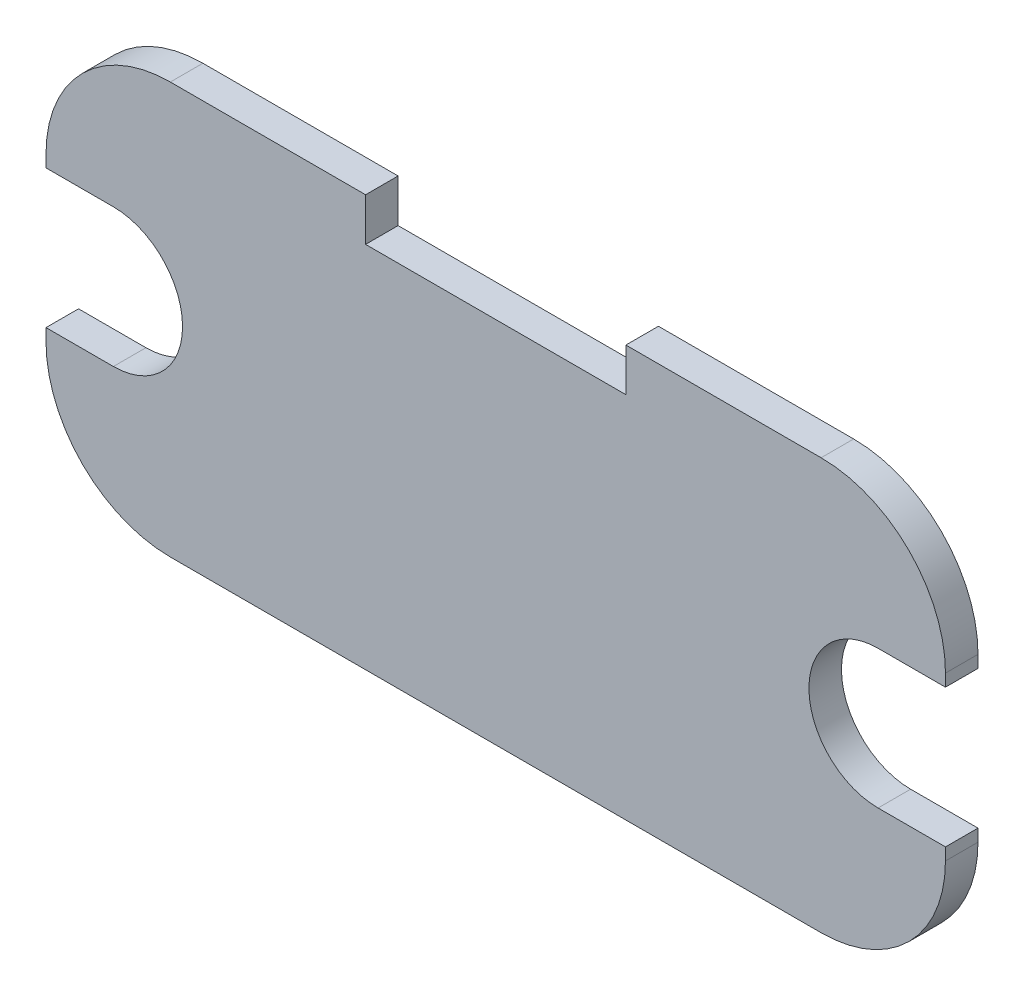
ISO-10303-21;
HEADER;
FILE_DESCRIPTION(('STEP AP214'),'2;1');
FILE_NAME('part.step','',(''),(''),'','','');
FILE_SCHEMA(('AUTOMOTIVE_DESIGN { 1 0 10303 214 1 1 1 1 }'));
ENDSEC;
DATA;
#1=APPLICATION_CONTEXT('core data for automotive mechanical design processes');
#2=APPLICATION_PROTOCOL_DEFINITION('international standard','automotive_design',2000,#1);
#3=PRODUCT_CONTEXT('',#1,'mechanical');
#4=PRODUCT('Part','Part','',(#3));
#5=PRODUCT_RELATED_PRODUCT_CATEGORY('part','',(#4));
#6=PRODUCT_DEFINITION_FORMATION('','',#4);
#7=PRODUCT_DEFINITION_CONTEXT('part definition',#1,'design');
#8=PRODUCT_DEFINITION('design','',#6,#7);
#9=PRODUCT_DEFINITION_SHAPE('','',#8);
#10=(LENGTH_UNIT() NAMED_UNIT(*) SI_UNIT(.MILLI.,.METRE.));
#11=(NAMED_UNIT(*) PLANE_ANGLE_UNIT() SI_UNIT($,.RADIAN.));
#12=(NAMED_UNIT(*) SI_UNIT($,.STERADIAN.) SOLID_ANGLE_UNIT());
#13=UNCERTAINTY_MEASURE_WITH_UNIT(LENGTH_MEASURE(1.E-05),#10,'distance_accuracy_value','');
#14=(GEOMETRIC_REPRESENTATION_CONTEXT(3) GLOBAL_UNCERTAINTY_ASSIGNED_CONTEXT((#13)) GLOBAL_UNIT_ASSIGNED_CONTEXT((#10,
#11,#12)) REPRESENTATION_CONTEXT('',''));
#15=CARTESIAN_POINT('',(0.,0.,0.));
#16=DIRECTION('',(0.,0.,1.));
#17=DIRECTION('',(1.,0.,0.));
#18=AXIS2_PLACEMENT_3D('',#15,#16,#17);
#19=CARTESIAN_POINT('',(27.6424107016852,0.,2.));
#20=DIRECTION('',(1.,0.,0.));
#21=DIRECTION('',(0.,0.,-1.));
#22=AXIS2_PLACEMENT_3D('',#19,#20,#21);
#23=PLANE('',#22);
#24=DIRECTION('',(0.,0.,1.));
#25=VECTOR('',#24,1.);
#26=CARTESIAN_POINT('',(27.6424107016852,7.25000000000002,2.));
#27=LINE('',#26,#25);
#28=CARTESIAN_POINT('',(27.6424107016852,7.25000000000002,0.));
#29=VERTEX_POINT('',#28);
#30=CARTESIAN_POINT('',(27.6424107016852,7.25000000000002,2.));
#31=VERTEX_POINT('',#30);
#32=EDGE_CURVE('E201',#29,#31,#27,.T.);
#33=ORIENTED_EDGE('',*,*,#32,.F.);
#34=DIRECTION('',(0.,-1.,0.));
#35=VECTOR('',#34,1.);
#36=CARTESIAN_POINT('',(27.6424107016852,0.,0.));
#37=LINE('',#36,#35);
#38=CARTESIAN_POINT('',(27.6424107016852,8.,0.));
#39=VERTEX_POINT('',#38);
#40=EDGE_CURVE('E268',#39,#29,#37,.T.);
#41=ORIENTED_EDGE('',*,*,#40,.F.);
#42=DIRECTION('',(0.,0.,-1.));
#43=VECTOR('',#42,1.);
#44=CARTESIAN_POINT('',(27.6424107016852,8.,2.));
#45=LINE('',#44,#43);
#46=CARTESIAN_POINT('',(27.6424107016852,8.,2.));
#47=VERTEX_POINT('',#46);
#48=EDGE_CURVE('E313',#47,#39,#45,.T.);
#49=ORIENTED_EDGE('',*,*,#48,.F.);
#50=DIRECTION('',(0.,-1.,0.));
#51=VECTOR('',#50,1.);
#52=CARTESIAN_POINT('',(27.6424107016852,0.,2.));
#53=LINE('',#52,#51);
#54=EDGE_CURVE('E233',#47,#31,#53,.T.);
#55=ORIENTED_EDGE('',*,*,#54,.T.);
#56=EDGE_LOOP('',(#33,#41,#49,#55));
#57=FACE_BOUND('',#56,.T.);
#58=ADVANCED_FACE('F36',(#57),#23,.T.);
#59=CARTESIAN_POINT('',(-27.6424107016852,0.,2.));
#60=DIRECTION('',(1.,0.,0.));
#61=DIRECTION('',(0.,0.,-1.));
#62=AXIS2_PLACEMENT_3D('',#59,#60,#61);
#63=PLANE('',#62);
#64=DIRECTION('',(0.,-1.,0.));
#65=VECTOR('',#64,1.);
#66=CARTESIAN_POINT('',(-27.6424107016852,0.,2.));
#67=LINE('',#66,#65);
#68=CARTESIAN_POINT('',(-27.6424107016852,-1.25,2.));
#69=VERTEX_POINT('',#68);
#70=CARTESIAN_POINT('',(-27.6424107016852,-2.,2.));
#71=VERTEX_POINT('',#70);
#72=EDGE_CURVE('E254',#69,#71,#67,.T.);
#73=ORIENTED_EDGE('',*,*,#72,.F.);
#74=DIRECTION('',(0.,0.,-1.));
#75=VECTOR('',#74,1.);
#76=CARTESIAN_POINT('',(-27.6424107016852,-1.25,2.));
#77=LINE('',#76,#75);
#78=CARTESIAN_POINT('',(-27.6424107016852,-1.25,0.));
#79=VERTEX_POINT('',#78);
#80=EDGE_CURVE('E221',#69,#79,#77,.T.);
#81=ORIENTED_EDGE('',*,*,#80,.T.);
#82=DIRECTION('',(0.,-1.,0.));
#83=VECTOR('',#82,1.);
#84=CARTESIAN_POINT('',(-27.6424107016852,0.,0.));
#85=LINE('',#84,#83);
#86=CARTESIAN_POINT('',(-27.6424107016852,-2.,0.));
#87=VERTEX_POINT('',#86);
#88=EDGE_CURVE('E288',#79,#87,#85,.T.);
#89=ORIENTED_EDGE('',*,*,#88,.T.);
#90=DIRECTION('',(0.,0.,-1.));
#91=VECTOR('',#90,1.);
#92=CARTESIAN_POINT('',(-27.6424107016852,-2.,2.));
#93=LINE('',#92,#91);
#94=EDGE_CURVE('E295',#71,#87,#93,.T.);
#95=ORIENTED_EDGE('',*,*,#94,.F.);
#96=EDGE_LOOP('',(#73,#81,#89,#95));
#97=FACE_BOUND('',#96,.T.);
#98=ADVANCED_FACE('F328',(#97),#63,.F.);
#99=CARTESIAN_POINT('',(0.,-9.64241070168522,2.));
#100=DIRECTION('',(0.,1.,0.));
#101=DIRECTION('',(-1.,0.,0.));
#102=AXIS2_PLACEMENT_3D('',#99,#100,#101);
#103=PLANE('',#102);
#104=DIRECTION('',(1.,0.,0.));
#105=VECTOR('',#104,1.);
#106=CARTESIAN_POINT('',(0.,-9.64241070168522,0.));
#107=LINE('',#106,#105);
#108=CARTESIAN_POINT('',(-20.,-9.64241070168522,0.));
#109=VERTEX_POINT('',#108);
#110=CARTESIAN_POINT('',(20.,-9.64241070168522,0.));
#111=VERTEX_POINT('',#110);
#112=EDGE_CURVE('E224',#109,#111,#107,.T.);
#113=ORIENTED_EDGE('',*,*,#112,.T.);
#114=DIRECTION('',(0.,0.,-1.));
#115=VECTOR('',#114,1.);
#116=CARTESIAN_POINT('',(20.,-9.64241070168522,2.));
#117=LINE('',#116,#115);
#118=CARTESIAN_POINT('',(20.,-9.64241070168522,2.));
#119=VERTEX_POINT('',#118);
#120=EDGE_CURVE('E318',#119,#111,#117,.T.);
#121=ORIENTED_EDGE('',*,*,#120,.F.);
#122=DIRECTION('',(1.,0.,0.));
#123=VECTOR('',#122,1.);
#124=CARTESIAN_POINT('',(0.,-9.64241070168522,2.));
#125=LINE('',#124,#123);
#126=CARTESIAN_POINT('',(-20.,-9.64241070168522,2.));
#127=VERTEX_POINT('',#126);
#128=EDGE_CURVE('E225',#127,#119,#125,.T.);
#129=ORIENTED_EDGE('',*,*,#128,.F.);
#130=DIRECTION('',(0.,0.,-1.));
#131=VECTOR('',#130,1.);
#132=CARTESIAN_POINT('',(-20.,-9.64241070168522,2.));
#133=LINE('',#132,#131);
#134=EDGE_CURVE('E261',#127,#109,#133,.T.);
#135=ORIENTED_EDGE('',*,*,#134,.T.);
#136=EDGE_LOOP('',(#113,#121,#129,#135));
#137=FACE_BOUND('',#136,.T.);
#138=ADVANCED_FACE('F38',(#137),#103,.F.);
#139=CARTESIAN_POINT('',(20.,-2.,2.));
#140=DIRECTION('',(0.,0.,-1.));
#141=DIRECTION('',(-1.,0.,0.));
#142=AXIS2_PLACEMENT_3D('',#139,#140,#141);
#143=CYLINDRICAL_SURFACE('',#142,7.64241070168523);
#144=CARTESIAN_POINT('',(20.,-2.,0.));
#145=DIRECTION('',(0.,0.,1.));
#146=DIRECTION('',(1.,0.,0.));
#147=AXIS2_PLACEMENT_3D('',#144,#145,#146);
#148=CIRCLE('',#147,7.64241070168523);
#149=CARTESIAN_POINT('',(27.6424107016852,-2.,0.));
#150=VERTEX_POINT('',#149);
#151=EDGE_CURVE('E264',#111,#150,#148,.T.);
#152=ORIENTED_EDGE('',*,*,#151,.T.);
#153=DIRECTION('',(0.,0.,-1.));
#154=VECTOR('',#153,1.);
#155=CARTESIAN_POINT('',(27.6424107016852,-2.,2.));
#156=LINE('',#155,#154);
#157=CARTESIAN_POINT('',(27.6424107016852,-2.,2.));
#158=VERTEX_POINT('',#157);
#159=EDGE_CURVE('E315',#158,#150,#156,.T.);
#160=ORIENTED_EDGE('',*,*,#159,.F.);
#161=CARTESIAN_POINT('',(20.,-2.,2.));
#162=DIRECTION('',(0.,0.,1.));
#163=DIRECTION('',(1.,0.,0.));
#164=AXIS2_PLACEMENT_3D('',#161,#162,#163);
#165=CIRCLE('',#164,7.64241070168523);
#166=EDGE_CURVE('E228',#119,#158,#165,.T.);
#167=ORIENTED_EDGE('',*,*,#166,.F.);
#168=ORIENTED_EDGE('',*,*,#120,.T.);
#169=EDGE_LOOP('',(#152,#160,#167,#168));
#170=FACE_BOUND('',#169,.T.);
#171=ADVANCED_FACE('F388',(#170),#143,.T.);
#172=DIRECTION('',(0.,0.,-1.));
#173=VECTOR('',#172,1.);
#174=CARTESIAN_POINT('',(27.6424107016852,-1.24999999999998,2.));
#175=LINE('',#174,#173);
#176=CARTESIAN_POINT('',(27.6424107016852,-1.24999999999998,2.));
#177=VERTEX_POINT('',#176);
#178=CARTESIAN_POINT('',(27.6424107016852,-1.24999999999998,0.));
#179=VERTEX_POINT('',#178);
#180=EDGE_CURVE('E51',#177,#179,#175,.T.);
#181=ORIENTED_EDGE('',*,*,#180,.F.);
#182=EDGE_CURVE('E232',#177,#158,#53,.T.);
#183=ORIENTED_EDGE('',*,*,#182,.T.);
#184=ORIENTED_EDGE('',*,*,#159,.T.);
#185=EDGE_CURVE('E267',#179,#150,#37,.T.);
#186=ORIENTED_EDGE('',*,*,#185,.F.);
#187=EDGE_LOOP('',(#181,#183,#184,#186));
#188=FACE_BOUND('',#187,.T.);
#189=ADVANCED_FACE('F382',(#188),#23,.T.);
#190=CARTESIAN_POINT('',(20.,8.,2.));
#191=DIRECTION('',(0.,0.,-1.));
#192=DIRECTION('',(-1.,0.,0.));
#193=AXIS2_PLACEMENT_3D('',#190,#191,#192);
#194=CYLINDRICAL_SURFACE('',#193,7.64241070168523);
#195=CARTESIAN_POINT('',(20.,8.,0.));
#196=DIRECTION('',(0.,0.,1.));
#197=DIRECTION('',(1.,0.,0.));
#198=AXIS2_PLACEMENT_3D('',#195,#196,#197);
#199=CIRCLE('',#198,7.64241070168523);
#200=CARTESIAN_POINT('',(20.,15.6424107016852,0.));
#201=VERTEX_POINT('',#200);
#202=EDGE_CURVE('E270',#201,#39,#199,.F.);
#203=ORIENTED_EDGE('',*,*,#202,.F.);
#204=DIRECTION('',(0.,0.,-1.));
#205=VECTOR('',#204,1.);
#206=CARTESIAN_POINT('',(20.,15.6424107016852,2.));
#207=LINE('',#206,#205);
#208=CARTESIAN_POINT('',(20.,15.6424107016852,2.));
#209=VERTEX_POINT('',#208);
#210=EDGE_CURVE('E311',#209,#201,#207,.T.);
#211=ORIENTED_EDGE('',*,*,#210,.F.);
#212=CARTESIAN_POINT('',(20.,8.,2.));
#213=DIRECTION('',(0.,0.,1.));
#214=DIRECTION('',(1.,0.,0.));
#215=AXIS2_PLACEMENT_3D('',#212,#213,#214);
#216=CIRCLE('',#215,7.64241070168523);
#217=EDGE_CURVE('E236',#209,#47,#216,.F.);
#218=ORIENTED_EDGE('',*,*,#217,.T.);
#219=ORIENTED_EDGE('',*,*,#48,.T.);
#220=EDGE_LOOP('',(#203,#211,#218,#219));
#221=FACE_BOUND('',#220,.T.);
#222=ADVANCED_FACE('F373',(#221),#194,.T.);
#223=CARTESIAN_POINT('',(0.,15.6424107016852,2.));
#224=DIRECTION('',(0.,1.,0.));
#225=DIRECTION('',(-1.,0.,0.));
#226=AXIS2_PLACEMENT_3D('',#223,#224,#225);
#227=PLANE('',#226);
#228=DIRECTION('',(1.,0.,0.));
#229=VECTOR('',#228,1.);
#230=CARTESIAN_POINT('',(0.,15.6424107016852,0.));
#231=LINE('',#230,#229);
#232=CARTESIAN_POINT('',(8.,15.6424107016852,0.));
#233=VERTEX_POINT('',#232);
#234=EDGE_CURVE('E273',#233,#201,#231,.T.);
#235=ORIENTED_EDGE('',*,*,#234,.F.);
#236=DIRECTION('',(0.,0.,-1.));
#237=VECTOR('',#236,1.);
#238=CARTESIAN_POINT('',(8.,15.6424107016852,2.));
#239=LINE('',#238,#237);
#240=CARTESIAN_POINT('',(8.,15.6424107016852,2.));
#241=VERTEX_POINT('',#240);
#242=EDGE_CURVE('E309',#241,#233,#239,.T.);
#243=ORIENTED_EDGE('',*,*,#242,.F.);
#244=DIRECTION('',(1.,0.,0.));
#245=VECTOR('',#244,1.);
#246=CARTESIAN_POINT('',(0.,15.6424107016852,2.));
#247=LINE('',#246,#245);
#248=EDGE_CURVE('E239',#241,#209,#247,.T.);
#249=ORIENTED_EDGE('',*,*,#248,.T.);
#250=ORIENTED_EDGE('',*,*,#210,.T.);
#251=EDGE_LOOP('',(#235,#243,#249,#250));
#252=FACE_BOUND('',#251,.T.);
#253=ADVANCED_FACE('F369',(#252),#227,.T.);
#254=CARTESIAN_POINT('',(8.00000000000001,0.,2.));
#255=DIRECTION('',(-1.,0.,0.));
#256=DIRECTION('',(0.,-1.,0.));
#257=AXIS2_PLACEMENT_3D('',#254,#255,#256);
#258=PLANE('',#257);
#259=DIRECTION('',(0.,1.,0.));
#260=VECTOR('',#259,1.);
#261=CARTESIAN_POINT('',(8.00000000000001,0.,0.));
#262=LINE('',#261,#260);
#263=CARTESIAN_POINT('',(8.,13.,0.));
#264=VERTEX_POINT('',#263);
#265=EDGE_CURVE('E276',#264,#233,#262,.T.);
#266=ORIENTED_EDGE('',*,*,#265,.F.);
#267=DIRECTION('',(0.,0.,-1.));
#268=VECTOR('',#267,1.);
#269=CARTESIAN_POINT('',(8.,13.,2.));
#270=LINE('',#269,#268);
#271=CARTESIAN_POINT('',(8.,13.,2.));
#272=VERTEX_POINT('',#271);
#273=EDGE_CURVE('E307',#272,#264,#270,.T.);
#274=ORIENTED_EDGE('',*,*,#273,.F.);
#275=DIRECTION('',(0.,1.,0.));
#276=VECTOR('',#275,1.);
#277=CARTESIAN_POINT('',(8.00000000000001,0.,2.));
#278=LINE('',#277,#276);
#279=EDGE_CURVE('E242',#272,#241,#278,.T.);
#280=ORIENTED_EDGE('',*,*,#279,.T.);
#281=ORIENTED_EDGE('',*,*,#242,.T.);
#282=EDGE_LOOP('',(#266,#274,#280,#281));
#283=FACE_BOUND('',#282,.T.);
#284=ADVANCED_FACE('F365',(#283),#258,.T.);
#285=CARTESIAN_POINT('',(0.,13.,2.));
#286=DIRECTION('',(0.,1.,0.));
#287=DIRECTION('',(-1.,0.,0.));
#288=AXIS2_PLACEMENT_3D('',#285,#286,#287);
#289=PLANE('',#288);
#290=DIRECTION('',(1.,0.,0.));
#291=VECTOR('',#290,1.);
#292=CARTESIAN_POINT('',(0.,13.,0.));
#293=LINE('',#292,#291);
#294=CARTESIAN_POINT('',(-8.,13.,0.));
#295=VERTEX_POINT('',#294);
#296=EDGE_CURVE('E280',#295,#264,#293,.T.);
#297=ORIENTED_EDGE('',*,*,#296,.F.);
#298=DIRECTION('',(0.,0.,-1.));
#299=VECTOR('',#298,1.);
#300=CARTESIAN_POINT('',(-8.,13.,2.));
#301=LINE('',#300,#299);
#302=CARTESIAN_POINT('',(-8.,13.,2.));
#303=VERTEX_POINT('',#302);
#304=EDGE_CURVE('E305',#303,#295,#301,.T.);
#305=ORIENTED_EDGE('',*,*,#304,.F.);
#306=DIRECTION('',(1.,0.,0.));
#307=VECTOR('',#306,1.);
#308=CARTESIAN_POINT('',(0.,13.,2.));
#309=LINE('',#308,#307);
#310=EDGE_CURVE('E246',#303,#272,#309,.T.);
#311=ORIENTED_EDGE('',*,*,#310,.T.);
#312=ORIENTED_EDGE('',*,*,#273,.T.);
#313=EDGE_LOOP('',(#297,#305,#311,#312));
#314=FACE_BOUND('',#313,.T.);
#315=ADVANCED_FACE('F361',(#314),#289,.T.);
#316=CARTESIAN_POINT('',(-8.00000000000001,0.,2.));
#317=DIRECTION('',(1.,0.,0.));
#318=DIRECTION('',(0.,1.,0.));
#319=AXIS2_PLACEMENT_3D('',#316,#317,#318);
#320=PLANE('',#319);
#321=DIRECTION('',(0.,-1.,0.));
#322=VECTOR('',#321,1.);
#323=CARTESIAN_POINT('',(-8.00000000000001,0.,0.));
#324=LINE('',#323,#322);
#325=CARTESIAN_POINT('',(-8.,15.6424107016852,0.));
#326=VERTEX_POINT('',#325);
#327=EDGE_CURVE('E283',#326,#295,#324,.T.);
#328=ORIENTED_EDGE('',*,*,#327,.F.);
#329=DIRECTION('',(0.,0.,-1.));
#330=VECTOR('',#329,1.);
#331=CARTESIAN_POINT('',(-8.,15.6424107016852,2.));
#332=LINE('',#331,#330);
#333=CARTESIAN_POINT('',(-8.,15.6424107016852,2.));
#334=VERTEX_POINT('',#333);
#335=EDGE_CURVE('E303',#334,#326,#332,.T.);
#336=ORIENTED_EDGE('',*,*,#335,.F.);
#337=DIRECTION('',(0.,-1.,0.));
#338=VECTOR('',#337,1.);
#339=CARTESIAN_POINT('',(-8.00000000000001,0.,2.));
#340=LINE('',#339,#338);
#341=EDGE_CURVE('E249',#334,#303,#340,.T.);
#342=ORIENTED_EDGE('',*,*,#341,.T.);
#343=ORIENTED_EDGE('',*,*,#304,.T.);
#344=EDGE_LOOP('',(#328,#336,#342,#343));
#345=FACE_BOUND('',#344,.T.);
#346=ADVANCED_FACE('F357',(#345),#320,.T.);
#347=CARTESIAN_POINT('',(-20.,15.6424107016852,0.));
#348=VERTEX_POINT('',#347);
#349=EDGE_CURVE('E277',#348,#326,#231,.T.);
#350=ORIENTED_EDGE('',*,*,#349,.F.);
#351=DIRECTION('',(0.,0.,-1.));
#352=VECTOR('',#351,1.);
#353=CARTESIAN_POINT('',(-20.,15.6424107016852,2.));
#354=LINE('',#353,#352);
#355=CARTESIAN_POINT('',(-20.,15.6424107016852,2.));
#356=VERTEX_POINT('',#355);
#357=EDGE_CURVE('E301',#356,#348,#354,.T.);
#358=ORIENTED_EDGE('',*,*,#357,.F.);
#359=EDGE_CURVE('E243',#356,#334,#247,.T.);
#360=ORIENTED_EDGE('',*,*,#359,.T.);
#361=ORIENTED_EDGE('',*,*,#335,.T.);
#362=EDGE_LOOP('',(#350,#358,#360,#361));
#363=FACE_BOUND('',#362,.T.);
#364=ADVANCED_FACE('F352',(#363),#227,.T.);
#365=CARTESIAN_POINT('',(-20.,8.,2.));
#366=DIRECTION('',(0.,0.,-1.));
#367=DIRECTION('',(-1.,0.,0.));
#368=AXIS2_PLACEMENT_3D('',#365,#366,#367);
#369=CYLINDRICAL_SURFACE('',#368,7.64241070168522);
#370=CARTESIAN_POINT('',(-20.,8.,0.));
#371=DIRECTION('',(0.,0.,1.));
#372=DIRECTION('',(1.,0.,0.));
#373=AXIS2_PLACEMENT_3D('',#370,#371,#372);
#374=CIRCLE('',#373,7.64241070168522);
#375=CARTESIAN_POINT('',(-27.6424107016852,8.,0.));
#376=VERTEX_POINT('',#375);
#377=EDGE_CURVE('E286',#348,#376,#374,.T.);
#378=ORIENTED_EDGE('',*,*,#377,.T.);
#379=DIRECTION('',(0.,0.,-1.));
#380=VECTOR('',#379,1.);
#381=CARTESIAN_POINT('',(-27.6424107016852,8.,2.));
#382=LINE('',#381,#380);
#383=CARTESIAN_POINT('',(-27.6424107016852,8.,2.));
#384=VERTEX_POINT('',#383);
#385=EDGE_CURVE('E298',#384,#376,#382,.T.);
#386=ORIENTED_EDGE('',*,*,#385,.F.);
#387=CARTESIAN_POINT('',(-20.,8.,2.));
#388=DIRECTION('',(0.,0.,1.));
#389=DIRECTION('',(1.,0.,0.));
#390=AXIS2_PLACEMENT_3D('',#387,#388,#389);
#391=CIRCLE('',#390,7.64241070168522);
#392=EDGE_CURVE('E252',#356,#384,#391,.T.);
#393=ORIENTED_EDGE('',*,*,#392,.F.);
#394=ORIENTED_EDGE('',*,*,#357,.T.);
#395=EDGE_LOOP('',(#378,#386,#393,#394));
#396=FACE_BOUND('',#395,.T.);
#397=ADVANCED_FACE('F347',(#396),#369,.T.);
#398=CARTESIAN_POINT('',(-27.6424107016852,7.25,0.));
#399=VERTEX_POINT('',#398);
#400=EDGE_CURVE('E289',#376,#399,#85,.T.);
#401=ORIENTED_EDGE('',*,*,#400,.T.);
#402=DIRECTION('',(0.,0.,1.));
#403=VECTOR('',#402,1.);
#404=CARTESIAN_POINT('',(-27.6424107016852,7.25,2.));
#405=LINE('',#404,#403);
#406=CARTESIAN_POINT('',(-27.6424107016852,7.25,2.));
#407=VERTEX_POINT('',#406);
#408=EDGE_CURVE('E59',#399,#407,#405,.T.);
#409=ORIENTED_EDGE('',*,*,#408,.T.);
#410=EDGE_CURVE('E255',#384,#407,#67,.T.);
#411=ORIENTED_EDGE('',*,*,#410,.F.);
#412=ORIENTED_EDGE('',*,*,#385,.T.);
#413=EDGE_LOOP('',(#401,#409,#411,#412));
#414=FACE_BOUND('',#413,.T.);
#415=ADVANCED_FACE('F342',(#414),#63,.F.);
#416=CARTESIAN_POINT('',(-20.,-2.,2.));
#417=DIRECTION('',(0.,0.,-1.));
#418=DIRECTION('',(-1.,0.,0.));
#419=AXIS2_PLACEMENT_3D('',#416,#417,#418);
#420=CYLINDRICAL_SURFACE('',#419,7.64241070168522);
#421=CARTESIAN_POINT('',(-20.,-2.,0.));
#422=DIRECTION('',(0.,0.,1.));
#423=DIRECTION('',(1.,0.,0.));
#424=AXIS2_PLACEMENT_3D('',#421,#422,#423);
#425=CIRCLE('',#424,7.64241070168522);
#426=EDGE_CURVE('E229',#109,#87,#425,.F.);
#427=ORIENTED_EDGE('',*,*,#426,.F.);
#428=ORIENTED_EDGE('',*,*,#134,.F.);
#429=CARTESIAN_POINT('',(-20.,-2.,2.));
#430=DIRECTION('',(0.,0.,1.));
#431=DIRECTION('',(1.,0.,0.));
#432=AXIS2_PLACEMENT_3D('',#429,#430,#431);
#433=CIRCLE('',#432,7.64241070168522);
#434=EDGE_CURVE('E258',#127,#71,#433,.F.);
#435=ORIENTED_EDGE('',*,*,#434,.T.);
#436=ORIENTED_EDGE('',*,*,#94,.T.);
#437=EDGE_LOOP('',(#427,#428,#435,#436));
#438=FACE_BOUND('',#437,.T.);
#439=ADVANCED_FACE('F392',(#438),#420,.T.);
#440=CARTESIAN_POINT('',(0.,0.,2.));
#441=DIRECTION('',(0.,0.,1.));
#442=DIRECTION('',(1.,0.,0.));
#443=AXIS2_PLACEMENT_3D('',#440,#441,#442);
#444=PLANE('',#443);
#445=DIRECTION('',(-1.,0.,0.));
#446=VECTOR('',#445,1.);
#447=CARTESIAN_POINT('',(23.5,7.25000000000002,2.));
#448=LINE('',#447,#446);
#449=CARTESIAN_POINT('',(23.5,7.25000000000002,2.));
#450=VERTEX_POINT('',#449);
#451=EDGE_CURVE('E192',#31,#450,#448,.T.);
#452=ORIENTED_EDGE('',*,*,#451,.F.);
#453=ORIENTED_EDGE('',*,*,#54,.F.);
#454=ORIENTED_EDGE('',*,*,#217,.F.);
#455=ORIENTED_EDGE('',*,*,#248,.F.);
#456=ORIENTED_EDGE('',*,*,#279,.F.);
#457=ORIENTED_EDGE('',*,*,#310,.F.);
#458=ORIENTED_EDGE('',*,*,#341,.F.);
#459=ORIENTED_EDGE('',*,*,#359,.F.);
#460=ORIENTED_EDGE('',*,*,#392,.T.);
#461=ORIENTED_EDGE('',*,*,#410,.T.);
#462=DIRECTION('',(-1.,0.,0.));
#463=VECTOR('',#462,1.);
#464=CARTESIAN_POINT('',(-23.5,7.25,2.));
#465=LINE('',#464,#463);
#466=CARTESIAN_POINT('',(-23.5,7.25,2.));
#467=VERTEX_POINT('',#466);
#468=EDGE_CURVE('E213',#467,#407,#465,.T.);
#469=ORIENTED_EDGE('',*,*,#468,.F.);
#470=CARTESIAN_POINT('',(-23.5,3.,2.));
#471=DIRECTION('',(0.,0.,1.));
#472=DIRECTION('',(1.,0.,0.));
#473=AXIS2_PLACEMENT_3D('',#470,#471,#472);
#474=CIRCLE('',#473,4.25);
#475=CARTESIAN_POINT('',(-23.5,-1.25,2.));
#476=VERTEX_POINT('',#475);
#477=EDGE_CURVE('E203',#476,#467,#474,.T.);
#478=ORIENTED_EDGE('',*,*,#477,.F.);
#479=DIRECTION('',(1.,0.,0.));
#480=VECTOR('',#479,1.);
#481=CARTESIAN_POINT('',(-23.5,-1.25,2.));
#482=LINE('',#481,#480);
#483=EDGE_CURVE('E208',#69,#476,#482,.T.);
#484=ORIENTED_EDGE('',*,*,#483,.F.);
#485=ORIENTED_EDGE('',*,*,#72,.T.);
#486=ORIENTED_EDGE('',*,*,#434,.F.);
#487=ORIENTED_EDGE('',*,*,#128,.T.);
#488=ORIENTED_EDGE('',*,*,#166,.T.);
#489=ORIENTED_EDGE('',*,*,#182,.F.);
#490=DIRECTION('',(1.,0.,0.));
#491=VECTOR('',#490,1.);
#492=CARTESIAN_POINT('',(23.5,-1.24999999999998,2.));
#493=LINE('',#492,#491);
#494=CARTESIAN_POINT('',(23.5,-1.24999999999998,2.));
#495=VERTEX_POINT('',#494);
#496=EDGE_CURVE('E194',#495,#177,#493,.T.);
#497=ORIENTED_EDGE('',*,*,#496,.F.);
#498=CARTESIAN_POINT('',(23.5,3.00000000000002,2.));
#499=DIRECTION('',(0.,0.,1.));
#500=DIRECTION('',(-1.,0.,0.));
#501=AXIS2_PLACEMENT_3D('',#498,#499,#500);
#502=CIRCLE('',#501,4.25);
#503=EDGE_CURVE('E181',#450,#495,#502,.T.);
#504=ORIENTED_EDGE('',*,*,#503,.F.);
#505=EDGE_LOOP('',(#452,#453,#454,#455,#456,#457,#458,#459,#460,#461,#469,#478,#484,#485,#486,
#487,#488,#489,#497,#504));
#506=FACE_BOUND('',#505,.T.);
#507=ADVANCED_FACE('F333',(#506),#444,.T.);
#508=CARTESIAN_POINT('',(0.,0.,0.));
#509=DIRECTION('',(0.,0.,1.));
#510=DIRECTION('',(1.,0.,0.));
#511=AXIS2_PLACEMENT_3D('',#508,#509,#510);
#512=PLANE('',#511);
#513=ORIENTED_EDGE('',*,*,#40,.T.);
#514=DIRECTION('',(-1.,0.,0.));
#515=VECTOR('',#514,1.);
#516=CARTESIAN_POINT('',(0.,7.25,0.));
#517=LINE('',#516,#515);
#518=CARTESIAN_POINT('',(23.5,7.25000000000002,0.));
#519=VERTEX_POINT('',#518);
#520=EDGE_CURVE('E11',#29,#519,#517,.T.);
#521=ORIENTED_EDGE('',*,*,#520,.T.);
#522=CARTESIAN_POINT('',(23.5,3.00000000000002,0.));
#523=DIRECTION('',(0.,0.,1.));
#524=DIRECTION('',(-1.,0.,0.));
#525=AXIS2_PLACEMENT_3D('',#522,#523,#524);
#526=CIRCLE('',#525,4.25);
#527=CARTESIAN_POINT('',(23.5,-1.24999999999998,0.));
#528=VERTEX_POINT('',#527);
#529=EDGE_CURVE('E179',#519,#528,#526,.T.);
#530=ORIENTED_EDGE('',*,*,#529,.T.);
#531=DIRECTION('',(1.,0.,0.));
#532=VECTOR('',#531,1.);
#533=CARTESIAN_POINT('',(23.5,-1.24999999999998,0.));
#534=LINE('',#533,#532);
#535=EDGE_CURVE('E184',#528,#179,#534,.T.);
#536=ORIENTED_EDGE('',*,*,#535,.T.);
#537=ORIENTED_EDGE('',*,*,#185,.T.);
#538=ORIENTED_EDGE('',*,*,#151,.F.);
#539=ORIENTED_EDGE('',*,*,#112,.F.);
#540=ORIENTED_EDGE('',*,*,#426,.T.);
#541=ORIENTED_EDGE('',*,*,#88,.F.);
#542=DIRECTION('',(1.,0.,0.));
#543=VECTOR('',#542,1.);
#544=CARTESIAN_POINT('',(0.,-1.25,0.));
#545=LINE('',#544,#543);
#546=CARTESIAN_POINT('',(-23.5,-1.25,0.));
#547=VERTEX_POINT('',#546);
#548=EDGE_CURVE('E44',#79,#547,#545,.T.);
#549=ORIENTED_EDGE('',*,*,#548,.T.);
#550=CARTESIAN_POINT('',(-23.5,3.,0.));
#551=DIRECTION('',(0.,0.,1.));
#552=DIRECTION('',(1.,0.,0.));
#553=AXIS2_PLACEMENT_3D('',#550,#551,#552);
#554=CIRCLE('',#553,4.25);
#555=CARTESIAN_POINT('',(-23.5,7.25,0.));
#556=VERTEX_POINT('',#555);
#557=EDGE_CURVE('E204',#547,#556,#554,.T.);
#558=ORIENTED_EDGE('',*,*,#557,.T.);
#559=DIRECTION('',(-1.,0.,0.));
#560=VECTOR('',#559,1.);
#561=CARTESIAN_POINT('',(-23.5,7.25,0.));
#562=LINE('',#561,#560);
#563=EDGE_CURVE('E207',#556,#399,#562,.T.);
#564=ORIENTED_EDGE('',*,*,#563,.T.);
#565=ORIENTED_EDGE('',*,*,#400,.F.);
#566=ORIENTED_EDGE('',*,*,#377,.F.);
#567=ORIENTED_EDGE('',*,*,#349,.T.);
#568=ORIENTED_EDGE('',*,*,#327,.T.);
#569=ORIENTED_EDGE('',*,*,#296,.T.);
#570=ORIENTED_EDGE('',*,*,#265,.T.);
#571=ORIENTED_EDGE('',*,*,#234,.T.);
#572=ORIENTED_EDGE('',*,*,#202,.T.);
#573=EDGE_LOOP('',(#513,#521,#530,#536,#537,#538,#539,#540,#541,#549,#558,#564,#565,#566,#567,
#568,#569,#570,#571,#572));
#574=FACE_BOUND('',#573,.T.);
#575=ADVANCED_FACE('F191',(#574),#512,.F.);
#576=CARTESIAN_POINT('',(-23.5,-1.25,0.));
#577=DIRECTION('',(0.,-1.,0.));
#578=DIRECTION('',(1.,0.,0.));
#579=AXIS2_PLACEMENT_3D('',#576,#577,#578);
#580=PLANE('',#579);
#581=ORIENTED_EDGE('',*,*,#483,.T.);
#582=DIRECTION('',(0.,0.,1.));
#583=VECTOR('',#582,1.);
#584=CARTESIAN_POINT('',(-23.5,-1.25,0.));
#585=LINE('',#584,#583);
#586=EDGE_CURVE('E216',#547,#476,#585,.T.);
#587=ORIENTED_EDGE('',*,*,#586,.F.);
#588=ORIENTED_EDGE('',*,*,#548,.F.);
#589=ORIENTED_EDGE('',*,*,#80,.F.);
#590=EDGE_LOOP('',(#581,#587,#588,#589));
#591=FACE_BOUND('',#590,.T.);
#592=ADVANCED_FACE('F324',(#591),#580,.F.);
#593=CARTESIAN_POINT('',(-23.5,7.25,0.));
#594=DIRECTION('',(0.,1.,0.));
#595=DIRECTION('',(-1.,0.,0.));
#596=AXIS2_PLACEMENT_3D('',#593,#594,#595);
#597=PLANE('',#596);
#598=ORIENTED_EDGE('',*,*,#563,.F.);
#599=DIRECTION('',(0.,0.,1.));
#600=VECTOR('',#599,1.);
#601=CARTESIAN_POINT('',(-23.5,7.25,0.));
#602=LINE('',#601,#600);
#603=EDGE_CURVE('E210',#556,#467,#602,.T.);
#604=ORIENTED_EDGE('',*,*,#603,.T.);
#605=ORIENTED_EDGE('',*,*,#468,.T.);
#606=ORIENTED_EDGE('',*,*,#408,.F.);
#607=EDGE_LOOP('',(#598,#604,#605,#606));
#608=FACE_BOUND('',#607,.T.);
#609=ADVANCED_FACE('F338',(#608),#597,.F.);
#610=CARTESIAN_POINT('',(-23.5,3.,0.));
#611=DIRECTION('',(0.,0.,1.));
#612=DIRECTION('',(1.,0.,0.));
#613=AXIS2_PLACEMENT_3D('',#610,#611,#612);
#614=CYLINDRICAL_SURFACE('',#613,4.25);
#615=ORIENTED_EDGE('',*,*,#477,.T.);
#616=ORIENTED_EDGE('',*,*,#603,.F.);
#617=ORIENTED_EDGE('',*,*,#557,.F.);
#618=ORIENTED_EDGE('',*,*,#586,.T.);
#619=EDGE_LOOP('',(#615,#616,#617,#618));
#620=FACE_BOUND('',#619,.T.);
#621=ADVANCED_FACE('F337',(#620),#614,.F.);
#622=CARTESIAN_POINT('',(23.5,3.00000000000002,0.));
#623=DIRECTION('',(0.,0.,1.));
#624=DIRECTION('',(1.,0.,0.));
#625=AXIS2_PLACEMENT_3D('',#622,#623,#624);
#626=CYLINDRICAL_SURFACE('',#625,4.25);
#627=ORIENTED_EDGE('',*,*,#503,.T.);
#628=DIRECTION('',(0.,0.,1.));
#629=VECTOR('',#628,1.);
#630=CARTESIAN_POINT('',(23.5,-1.24999999999998,0.));
#631=LINE('',#630,#629);
#632=EDGE_CURVE('E175',#528,#495,#631,.T.);
#633=ORIENTED_EDGE('',*,*,#632,.F.);
#634=ORIENTED_EDGE('',*,*,#529,.F.);
#635=DIRECTION('',(0.,0.,1.));
#636=VECTOR('',#635,1.);
#637=CARTESIAN_POINT('',(23.5,7.25000000000002,0.));
#638=LINE('',#637,#636);
#639=EDGE_CURVE('E183',#519,#450,#638,.T.);
#640=ORIENTED_EDGE('',*,*,#639,.T.);
#641=EDGE_LOOP('',(#627,#633,#634,#640));
#642=FACE_BOUND('',#641,.T.);
#643=ADVANCED_FACE('F176',(#642),#626,.F.);
#644=CARTESIAN_POINT('',(23.5,7.25000000000002,0.));
#645=DIRECTION('',(0.,1.,0.));
#646=DIRECTION('',(-1.,0.,0.));
#647=AXIS2_PLACEMENT_3D('',#644,#645,#646);
#648=PLANE('',#647);
#649=ORIENTED_EDGE('',*,*,#32,.T.);
#650=ORIENTED_EDGE('',*,*,#451,.T.);
#651=ORIENTED_EDGE('',*,*,#639,.F.);
#652=ORIENTED_EDGE('',*,*,#520,.F.);
#653=EDGE_LOOP('',(#649,#650,#651,#652));
#654=FACE_BOUND('',#653,.T.);
#655=ADVANCED_FACE('F379',(#654),#648,.F.);
#656=CARTESIAN_POINT('',(23.5,-1.24999999999998,0.));
#657=DIRECTION('',(0.,-1.,0.));
#658=DIRECTION('',(1.,0.,0.));
#659=AXIS2_PLACEMENT_3D('',#656,#657,#658);
#660=PLANE('',#659);
#661=ORIENTED_EDGE('',*,*,#180,.T.);
#662=ORIENTED_EDGE('',*,*,#535,.F.);
#663=ORIENTED_EDGE('',*,*,#632,.T.);
#664=ORIENTED_EDGE('',*,*,#496,.T.);
#665=EDGE_LOOP('',(#661,#662,#663,#664));
#666=FACE_BOUND('',#665,.T.);
#667=ADVANCED_FACE('F186',(#666),#660,.F.);
#668=CLOSED_SHELL('',(#58,#98,#138,#171,#189,#222,#253,#284,#315,#346,#364,#397,#415,#439,#507,
#575,#592,#609,#621,#643,#655,#667));
#669=MANIFOLD_SOLID_BREP('B2',#668);
#670=ADVANCED_BREP_SHAPE_REPRESENTATION('',(#18,#669),#14);
#671=SHAPE_DEFINITION_REPRESENTATION(#9,#670);
ENDSEC;
END-ISO-10303-21;
